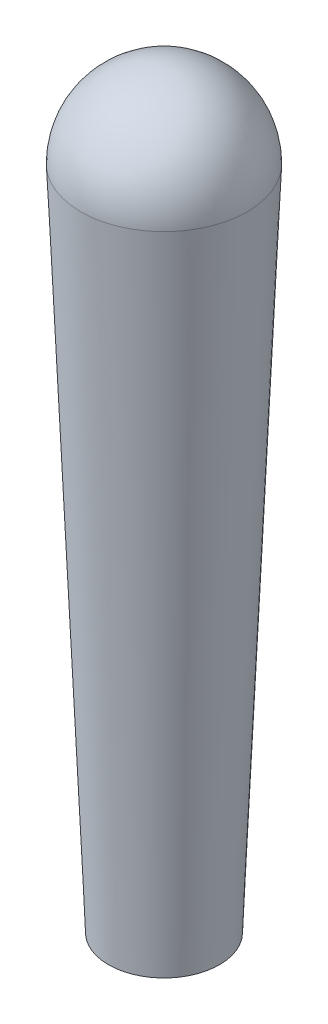
ISO-10303-21;
HEADER;
FILE_DESCRIPTION(('STEP AP214'),'2;1');
FILE_NAME('part.step','',(''),(''),'','','');
FILE_SCHEMA(('AUTOMOTIVE_DESIGN { 1 0 10303 214 1 1 1 1 }'));
ENDSEC;
DATA;
#1=APPLICATION_CONTEXT('core data for automotive mechanical design processes');
#2=APPLICATION_PROTOCOL_DEFINITION('international standard','automotive_design',2000,#1);
#3=PRODUCT_CONTEXT('',#1,'mechanical');
#4=PRODUCT('Part','Part','',(#3));
#5=PRODUCT_RELATED_PRODUCT_CATEGORY('part','',(#4));
#6=PRODUCT_DEFINITION_FORMATION('','',#4);
#7=PRODUCT_DEFINITION_CONTEXT('part definition',#1,'design');
#8=PRODUCT_DEFINITION('design','',#6,#7);
#9=PRODUCT_DEFINITION_SHAPE('','',#8);
#10=(LENGTH_UNIT() NAMED_UNIT(*) SI_UNIT(.MILLI.,.METRE.));
#11=(NAMED_UNIT(*) PLANE_ANGLE_UNIT() SI_UNIT($,.RADIAN.));
#12=(NAMED_UNIT(*) SI_UNIT($,.STERADIAN.) SOLID_ANGLE_UNIT());
#13=UNCERTAINTY_MEASURE_WITH_UNIT(LENGTH_MEASURE(1.E-05),#10,'distance_accuracy_value','');
#14=(GEOMETRIC_REPRESENTATION_CONTEXT(3) GLOBAL_UNCERTAINTY_ASSIGNED_CONTEXT((#13)) GLOBAL_UNIT_ASSIGNED_CONTEXT((#10,
#11,#12)) REPRESENTATION_CONTEXT('',''));
#15=CARTESIAN_POINT('',(0.,0.,0.));
#16=DIRECTION('',(0.,0.,1.));
#17=DIRECTION('',(1.,0.,0.));
#18=AXIS2_PLACEMENT_3D('',#15,#16,#17);
#19=CARTESIAN_POINT('',(0.,0.,0.));
#20=DIRECTION('',(0.,1.,0.));
#21=DIRECTION('',(0.,0.,1.));
#22=AXIS2_PLACEMENT_3D('',#19,#20,#21);
#23=PLANE('',#22);
#24=CARTESIAN_POINT('',(0.,0.,0.));
#25=DIRECTION('',(0.,1.,0.));
#26=DIRECTION('',(0.,0.,1.));
#27=AXIS2_PLACEMENT_3D('',#24,#25,#26);
#28=CIRCLE('',#27,1.);
#29=CARTESIAN_POINT('',(0.,0.,1.));
#30=VERTEX_POINT('',#29);
#31=EDGE_CURVE('E11',#30,#30,#28,.T.);
#32=ORIENTED_EDGE('',*,*,#31,.F.);
#33=EDGE_LOOP('',(#32));
#34=FACE_BOUND('',#33,.T.);
#35=ADVANCED_FACE('F36',(#34),#23,.F.);
#36=CARTESIAN_POINT('',(0.,0.,0.));
#37=DIRECTION('',(0.,1.,0.));
#38=DIRECTION('',(0.,0.,1.));
#39=AXIS2_PLACEMENT_3D('',#36,#37,#38);
#40=CONICAL_SURFACE('',#39,1.,0.0416425790985884);
#41=ORIENTED_EDGE('',*,*,#31,.T.);
#42=EDGE_LOOP('',(#41));
#43=FACE_BOUND('',#42,.T.);
#44=CARTESIAN_POINT('',(0.,12.,0.));
#45=DIRECTION('',(0.,1.,0.));
#46=DIRECTION('',(0.,0.,1.));
#47=AXIS2_PLACEMENT_3D('',#44,#45,#46);
#48=CIRCLE('',#47,1.5);
#49=CARTESIAN_POINT('',(0.,12.,1.5));
#50=VERTEX_POINT('',#49);
#51=EDGE_CURVE('E41',#50,#50,#48,.T.);
#52=ORIENTED_EDGE('',*,*,#51,.F.);
#53=EDGE_LOOP('',(#52));
#54=FACE_BOUND('',#53,.T.);
#55=ADVANCED_FACE('F38',(#43,#54),#40,.T.);
#56=CARTESIAN_POINT('',(0.,12.,0.));
#57=DIRECTION('',(0.,-1.,0.));
#58=DIRECTION('',(1.,0.,0.));
#59=AXIS2_PLACEMENT_3D('',#56,#57,#58);
#60=SPHERICAL_SURFACE('',#59,1.5);
#61=ORIENTED_EDGE('',*,*,#51,.T.);
#62=EDGE_LOOP('',(#61));
#63=FACE_BOUND('',#62,.T.);
#64=ADVANCED_FACE('F64',(#63),#60,.T.);
#65=CLOSED_SHELL('',(#35,#55,#64));
#66=MANIFOLD_SOLID_BREP('B2',#65);
#67=ADVANCED_BREP_SHAPE_REPRESENTATION('',(#18,#66),#14);
#68=SHAPE_DEFINITION_REPRESENTATION(#9,#67);
ENDSEC;
END-ISO-10303-21;
